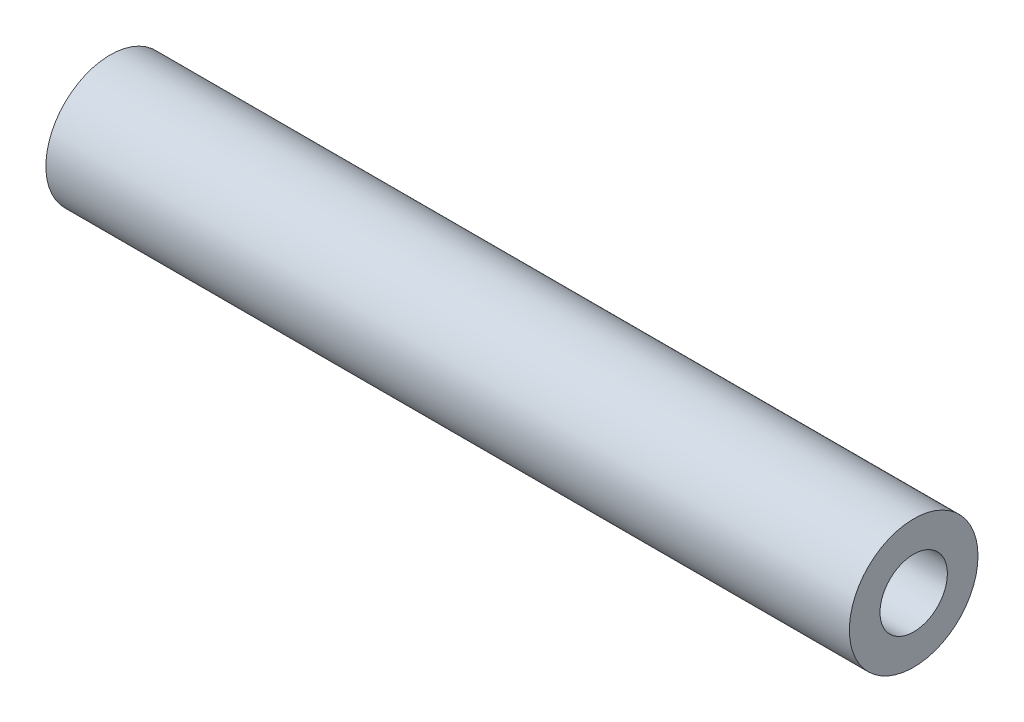
ISO-10303-21;
HEADER;
FILE_DESCRIPTION(('STEP AP214'),'2;1');
FILE_NAME('part.step','',(''),(''),'','','');
FILE_SCHEMA(('AUTOMOTIVE_DESIGN { 1 0 10303 214 1 1 1 1 }'));
ENDSEC;
DATA;
#1=APPLICATION_CONTEXT('core data for automotive mechanical design processes');
#2=APPLICATION_PROTOCOL_DEFINITION('international standard','automotive_design',2000,#1);
#3=PRODUCT_CONTEXT('',#1,'mechanical');
#4=PRODUCT('Part','Part','',(#3));
#5=PRODUCT_RELATED_PRODUCT_CATEGORY('part','',(#4));
#6=PRODUCT_DEFINITION_FORMATION('','',#4);
#7=PRODUCT_DEFINITION_CONTEXT('part definition',#1,'design');
#8=PRODUCT_DEFINITION('design','',#6,#7);
#9=PRODUCT_DEFINITION_SHAPE('','',#8);
#10=(LENGTH_UNIT() NAMED_UNIT(*) SI_UNIT(.MILLI.,.METRE.));
#11=(NAMED_UNIT(*) PLANE_ANGLE_UNIT() SI_UNIT($,.RADIAN.));
#12=(NAMED_UNIT(*) SI_UNIT($,.STERADIAN.) SOLID_ANGLE_UNIT());
#13=UNCERTAINTY_MEASURE_WITH_UNIT(LENGTH_MEASURE(1.E-05),#10,'distance_accuracy_value','');
#14=(GEOMETRIC_REPRESENTATION_CONTEXT(3) GLOBAL_UNCERTAINTY_ASSIGNED_CONTEXT((#13)) GLOBAL_UNIT_ASSIGNED_CONTEXT((#10,
#11,#12)) REPRESENTATION_CONTEXT('',''));
#15=CARTESIAN_POINT('',(0.,0.,0.));
#16=DIRECTION('',(0.,0.,1.));
#17=DIRECTION('',(1.,0.,0.));
#18=AXIS2_PLACEMENT_3D('',#15,#16,#17);
#19=CARTESIAN_POINT('',(-86.1943594012929,0.,3.06993608826518));
#20=DIRECTION('',(0.999999999999999,0.,0.));
#21=DIRECTION('',(0.,0.,-0.999999999999998));
#22=AXIS2_PLACEMENT_3D('',#19,#20,#21);
#23=PLANE('',#22);
#24=CARTESIAN_POINT('',(-86.1943594012929,0.,3.06993608826518));
#25=DIRECTION('',(0.999999999999999,0.,0.));
#26=DIRECTION('',(0.,0.,-0.999999999999998));
#27=AXIS2_PLACEMENT_3D('',#24,#25,#26);
#28=CIRCLE('',#27,3.302);
#29=CARTESIAN_POINT('',(-86.1943594012929,0.,-0.232063911734819));
#30=VERTEX_POINT('',#29);
#31=EDGE_CURVE('E55',#30,#30,#28,.T.);
#32=ORIENTED_EDGE('',*,*,#31,.T.);
#33=EDGE_LOOP('',(#32));
#34=FACE_BOUND('',#33,.T.);
#35=CARTESIAN_POINT('',(-86.1943594012929,0.,3.06993608826518));
#36=DIRECTION('',(0.999999999999999,0.,0.));
#37=DIRECTION('',(0.,0.,-0.999999999999998));
#38=AXIS2_PLACEMENT_3D('',#35,#36,#37);
#39=CIRCLE('',#38,6.302);
#40=CARTESIAN_POINT('',(-86.1943594012929,-1.00292996130236E-13,-3.23206391173481));
#41=VERTEX_POINT('',#40);
#42=EDGE_CURVE('E40',#41,#41,#39,.T.);
#43=ORIENTED_EDGE('',*,*,#42,.F.);
#44=EDGE_LOOP('',(#43));
#45=FACE_BOUND('',#44,.T.);
#46=ADVANCED_FACE('F36',(#34,#45),#23,.F.);
#47=CARTESIAN_POINT('',(-7.45435940129291,0.,3.06993608826523));
#48=DIRECTION('',(0.999999999999999,0.,0.));
#49=DIRECTION('',(0.,0.,-0.999999999999998));
#50=AXIS2_PLACEMENT_3D('',#47,#48,#49);
#51=PLANE('',#50);
#52=CARTESIAN_POINT('',(-7.45435940129291,0.,3.06993608826523));
#53=DIRECTION('',(0.999999999999999,0.,0.));
#54=DIRECTION('',(0.,0.,-0.999999999999998));
#55=AXIS2_PLACEMENT_3D('',#52,#53,#54);
#56=CIRCLE('',#55,3.302);
#57=CARTESIAN_POINT('',(-7.45435940129291,0.,-0.232063911734777));
#58=VERTEX_POINT('',#57);
#59=EDGE_CURVE('E50',#58,#58,#56,.T.);
#60=ORIENTED_EDGE('',*,*,#59,.F.);
#61=EDGE_LOOP('',(#60));
#62=FACE_BOUND('',#61,.T.);
#63=CARTESIAN_POINT('',(-7.45435940129291,0.,3.06993608826523));
#64=DIRECTION('',(0.999999999999999,0.,0.));
#65=DIRECTION('',(0.,0.,-0.999999999999998));
#66=AXIS2_PLACEMENT_3D('',#63,#64,#65);
#67=CIRCLE('',#66,6.302);
#68=CARTESIAN_POINT('',(-7.45435940129291,0.,-3.23206391173477));
#69=VERTEX_POINT('',#68);
#70=EDGE_CURVE('E11',#69,#69,#67,.T.);
#71=ORIENTED_EDGE('',*,*,#70,.T.);
#72=EDGE_LOOP('',(#71));
#73=FACE_BOUND('',#72,.T.);
#74=ADVANCED_FACE('F70',(#62,#73),#51,.T.);
#75=CARTESIAN_POINT('',(-86.1943594012929,0.,3.06993608826518));
#76=DIRECTION('',(0.999999999999999,0.,0.));
#77=DIRECTION('',(0.,0.,-0.999999999999998));
#78=AXIS2_PLACEMENT_3D('',#75,#76,#77);
#79=CYLINDRICAL_SURFACE('',#78,6.302);
#80=CARTESIAN_POINT('',(-7.45435940129291,0.,-3.23206391173477));
#81=CARTESIAN_POINT('',(-8.27456773462625,0.,-3.23206391173477));
#82=CARTESIAN_POINT('',(-9.09477606795958,0.,-3.23206391173477));
#83=CARTESIAN_POINT('',(-10.7351927346262,0.,-3.23206391173477));
#84=CARTESIAN_POINT('',(-11.5554010679596,0.,-3.23206391173477));
#85=CARTESIAN_POINT('',(-13.1958177346262,0.,-3.23206391173478));
#86=CARTESIAN_POINT('',(-14.0160260679596,0.,-3.23206391173478));
#87=CARTESIAN_POINT('',(-15.6564427346263,0.,-3.23206391173478));
#88=CARTESIAN_POINT('',(-16.4766510679596,0.,-3.23206391173478));
#89=CARTESIAN_POINT('',(-18.1170677346262,0.,-3.23206391173478));
#90=CARTESIAN_POINT('',(-18.9372760679596,0.,-3.23206391173478));
#91=CARTESIAN_POINT('',(-20.5776927346262,0.,-3.23206391173478));
#92=CARTESIAN_POINT('',(-21.3979010679596,0.,-3.23206391173478));
#93=CARTESIAN_POINT('',(-23.0383177346262,0.,-3.23206391173478));
#94=CARTESIAN_POINT('',(-23.8585260679596,0.,-3.23206391173478));
#95=CARTESIAN_POINT('',(-25.4989427346262,0.,-3.23206391173478));
#96=CARTESIAN_POINT('',(-26.3191510679596,0.,-3.23206391173478));
#97=CARTESIAN_POINT('',(-27.9595677346262,0.,-3.23206391173478));
#98=CARTESIAN_POINT('',(-28.7797760679596,0.,-3.23206391173478));
#99=CARTESIAN_POINT('',(-30.4201927346262,0.,-3.23206391173478));
#100=CARTESIAN_POINT('',(-31.2404010679596,0.,-3.23206391173478));
#101=CARTESIAN_POINT('',(-32.8808177346262,0.,-3.23206391173479));
#102=CARTESIAN_POINT('',(-33.7010260679596,0.,-3.23206391173479));
#103=CARTESIAN_POINT('',(-35.3414427346262,0.,-3.23206391173479));
#104=CARTESIAN_POINT('',(-36.1616510679596,0.,-3.23206391173479));
#105=CARTESIAN_POINT('',(-37.8020677346262,0.,-3.23206391173479));
#106=CARTESIAN_POINT('',(-38.6222760679596,0.,-3.23206391173479));
#107=CARTESIAN_POINT('',(-40.2626927346262,0.,-3.23206391173479));
#108=CARTESIAN_POINT('',(-41.0829010679596,0.,-3.23206391173479));
#109=CARTESIAN_POINT('',(-42.7233177346262,0.,-3.23206391173479));
#110=CARTESIAN_POINT('',(-43.5435260679596,0.,-3.23206391173479));
#111=CARTESIAN_POINT('',(-45.1839427346262,0.,-3.23206391173479));
#112=CARTESIAN_POINT('',(-46.0041510679596,0.,-3.23206391173479));
#113=CARTESIAN_POINT('',(-47.6445677346262,0.,-3.23206391173479));
#114=CARTESIAN_POINT('',(-48.4647760679596,0.,-3.23206391173479));
#115=CARTESIAN_POINT('',(-50.1051927346262,0.,-3.23206391173479));
#116=CARTESIAN_POINT('',(-50.9254010679596,0.,-3.2320639117348));
#117=CARTESIAN_POINT('',(-52.5658177346262,0.,-3.2320639117348));
#118=CARTESIAN_POINT('',(-53.3860260679596,0.,-3.2320639117348));
#119=CARTESIAN_POINT('',(-55.0264427346262,0.,-3.2320639117348));
#120=CARTESIAN_POINT('',(-55.8466510679595,0.,-3.2320639117348));
#121=CARTESIAN_POINT('',(-57.4870677346262,0.,-3.2320639117348));
#122=CARTESIAN_POINT('',(-58.3072760679596,0.,-3.2320639117348));
#123=CARTESIAN_POINT('',(-59.9476927346262,0.,-3.2320639117348));
#124=CARTESIAN_POINT('',(-60.7679010679595,0.,-3.2320639117348));
#125=CARTESIAN_POINT('',(-62.4083177346262,0.,-3.2320639117348));
#126=CARTESIAN_POINT('',(-63.2285260679595,0.,-3.2320639117348));
#127=CARTESIAN_POINT('',(-64.8689427346262,0.,-3.2320639117348));
#128=CARTESIAN_POINT('',(-65.6891510679595,0.,-3.2320639117348));
#129=CARTESIAN_POINT('',(-67.3295677346262,0.,-3.2320639117348));
#130=CARTESIAN_POINT('',(-68.1497760679596,0.,-3.2320639117348));
#131=CARTESIAN_POINT('',(-69.7901927346262,0.,-3.23206391173481));
#132=CARTESIAN_POINT('',(-70.6104010679595,0.,-3.23206391173481));
#133=CARTESIAN_POINT('',(-72.2508177346262,0.,-3.23206391173481));
#134=CARTESIAN_POINT('',(-73.0710260679595,0.,-3.23206391173481));
#135=CARTESIAN_POINT('',(-74.7114427346262,0.,-3.23206391173481));
#136=CARTESIAN_POINT('',(-75.5316510679595,0.,-3.23206391173481));
#137=CARTESIAN_POINT('',(-77.1720677346262,0.,-3.23206391173481));
#138=CARTESIAN_POINT('',(-77.9922760679595,0.,-3.23206391173481));
#139=CARTESIAN_POINT('',(-79.6326927346262,0.,-3.23206391173481));
#140=CARTESIAN_POINT('',(-80.4529010679595,0.,-3.23206391173481));
#141=CARTESIAN_POINT('',(-82.0933177346262,0.,-3.23206391173481));
#142=CARTESIAN_POINT('',(-82.9135260679595,0.,-3.23206391173481));
#143=CARTESIAN_POINT('',(-84.5539427346262,0.,-3.23206391173481));
#144=CARTESIAN_POINT('',(-85.3741510679595,0.,-3.23206391173481));
#145=CARTESIAN_POINT('',(-86.1943594012929,-1.00292996130236E-13,-3.23206391173481));
#146=B_SPLINE_CURVE_WITH_KNOTS('',3,(#80,#81,#82,#83,#84,#85,#86,#87,#88,#89,#90,#91,#92,#93,
#94,#95,#96,#97,#98,#99,#100,#101,#102,#103,#104,#105,#106,#107,#108,#109,#110,#111,#112,#113,
#114,#115,#116,#117,#118,#119,#120,#121,#122,#123,#124,#125,#126,#127,#128,#129,#130,#131,#132,
#133,#134,#135,#136,#137,#138,#139,#140,#141,#142,#143,#144,#145),.UNSPECIFIED.,.F.,.F.,(4,2,2,
2,2,2,2,2,2,2,2,2,2,2,2,2,2,2,2,2,2,2,2,2,2,2,2,2,2,2,2,2,4),(0.,2.46062500000001,4.92125,
7.38187500000001,9.8425,12.303125,14.76375,17.224375,19.685,22.145625,24.60625,27.066875,
29.5275,31.988125,34.44875,36.909375,39.37,41.830625,44.29125,46.751875,49.2125,51.673125,
54.13375,56.594375,59.055,61.515625,63.97625,66.436875,68.8975,71.358125,73.81875,76.279375,
78.74),.UNSPECIFIED.);
#147=EDGE_CURVE('BSEAM38',#69,#41,#146,.T.);
#148=ORIENTED_EDGE('',*,*,#70,.F.);
#149=ORIENTED_EDGE('',*,*,#42,.T.);
#150=ORIENTED_EDGE('',*,*,#147,.T.);
#151=ORIENTED_EDGE('',*,*,#147,.F.);
#152=EDGE_LOOP('',(#148,#150,#149,#151));
#153=FACE_BOUND('',#152,.T.);
#154=ADVANCED_FACE('F38',(#153),#79,.T.);
#155=CARTESIAN_POINT('',(-86.1943594012929,0.,3.06993608826518));
#156=DIRECTION('',(0.999999999999999,0.,0.));
#157=DIRECTION('',(0.,0.,-0.999999999999998));
#158=AXIS2_PLACEMENT_3D('',#155,#156,#157);
#159=CYLINDRICAL_SURFACE('',#158,3.302);
#160=CARTESIAN_POINT('',(-7.45435940129291,0.,-0.232063911734777));
#161=CARTESIAN_POINT('',(-8.27456773462625,0.,-0.232063911734778));
#162=CARTESIAN_POINT('',(-9.09477606795958,0.,-0.232063911734778));
#163=CARTESIAN_POINT('',(-10.7351927346262,0.,-0.232063911734779));
#164=CARTESIAN_POINT('',(-11.5554010679596,0.,-0.232063911734779));
#165=CARTESIAN_POINT('',(-13.1958177346262,0.,-0.23206391173478));
#166=CARTESIAN_POINT('',(-14.0160260679596,0.,-0.232063911734781));
#167=CARTESIAN_POINT('',(-15.6564427346263,0.,-0.232063911734781));
#168=CARTESIAN_POINT('',(-16.4766510679596,0.,-0.232063911734782));
#169=CARTESIAN_POINT('',(-18.1170677346262,0.,-0.232063911734783));
#170=CARTESIAN_POINT('',(-18.9372760679596,0.,-0.232063911734783));
#171=CARTESIAN_POINT('',(-20.5776927346262,0.,-0.232063911734784));
#172=CARTESIAN_POINT('',(-21.3979010679596,0.,-0.232063911734784));
#173=CARTESIAN_POINT('',(-23.0383177346262,0.,-0.232063911734785));
#174=CARTESIAN_POINT('',(-23.8585260679596,0.,-0.232063911734786));
#175=CARTESIAN_POINT('',(-25.4989427346262,0.,-0.232063911734787));
#176=CARTESIAN_POINT('',(-26.3191510679596,0.,-0.232063911734787));
#177=CARTESIAN_POINT('',(-27.9595677346262,0.,-0.232063911734788));
#178=CARTESIAN_POINT('',(-28.7797760679596,0.,-0.232063911734788));
#179=CARTESIAN_POINT('',(-30.4201927346262,0.,-0.232063911734789));
#180=CARTESIAN_POINT('',(-31.2404010679596,0.,-0.23206391173479));
#181=CARTESIAN_POINT('',(-32.8808177346262,0.,-0.23206391173479));
#182=CARTESIAN_POINT('',(-33.7010260679596,0.,-0.232063911734791));
#183=CARTESIAN_POINT('',(-35.3414427346262,0.,-0.232063911734792));
#184=CARTESIAN_POINT('',(-36.1616510679596,0.,-0.232063911734792));
#185=CARTESIAN_POINT('',(-37.8020677346262,0.,-0.232063911734793));
#186=CARTESIAN_POINT('',(-38.6222760679596,0.,-0.232063911734794));
#187=CARTESIAN_POINT('',(-40.2626927346262,0.,-0.232063911734794));
#188=CARTESIAN_POINT('',(-41.0829010679596,0.,-0.232063911734795));
#189=CARTESIAN_POINT('',(-42.7233177346262,0.,-0.232063911734796));
#190=CARTESIAN_POINT('',(-43.5435260679596,0.,-0.232063911734796));
#191=CARTESIAN_POINT('',(-45.1839427346262,0.,-0.232063911734797));
#192=CARTESIAN_POINT('',(-46.0041510679596,0.,-0.232063911734797));
#193=CARTESIAN_POINT('',(-47.6445677346262,0.,-0.232063911734798));
#194=CARTESIAN_POINT('',(-48.4647760679596,0.,-0.232063911734799));
#195=CARTESIAN_POINT('',(-50.1051927346262,0.,-0.2320639117348));
#196=CARTESIAN_POINT('',(-50.9254010679596,0.,-0.2320639117348));
#197=CARTESIAN_POINT('',(-52.5658177346262,0.,-0.232063911734801));
#198=CARTESIAN_POINT('',(-53.3860260679596,0.,-0.232063911734801));
#199=CARTESIAN_POINT('',(-55.0264427346262,0.,-0.232063911734802));
#200=CARTESIAN_POINT('',(-55.8466510679596,0.,-0.232063911734803));
#201=CARTESIAN_POINT('',(-57.4870677346262,0.,-0.232063911734803));
#202=CARTESIAN_POINT('',(-58.3072760679596,0.,-0.232063911734804));
#203=CARTESIAN_POINT('',(-59.9476927346262,0.,-0.232063911734805));
#204=CARTESIAN_POINT('',(-60.7679010679596,0.,-0.232063911734805));
#205=CARTESIAN_POINT('',(-62.4083177346262,0.,-0.232063911734806));
#206=CARTESIAN_POINT('',(-63.2285260679596,0.,-0.232063911734806));
#207=CARTESIAN_POINT('',(-64.8689427346262,0.,-0.232063911734807));
#208=CARTESIAN_POINT('',(-65.6891510679596,0.,-0.232063911734808));
#209=CARTESIAN_POINT('',(-67.3295677346262,0.,-0.232063911734809));
#210=CARTESIAN_POINT('',(-68.1497760679596,0.,-0.232063911734809));
#211=CARTESIAN_POINT('',(-69.7901927346262,0.,-0.23206391173481));
#212=CARTESIAN_POINT('',(-70.6104010679596,0.,-0.23206391173481));
#213=CARTESIAN_POINT('',(-72.2508177346262,0.,-0.232063911734811));
#214=CARTESIAN_POINT('',(-73.0710260679596,0.,-0.232063911734812));
#215=CARTESIAN_POINT('',(-74.7114427346262,0.,-0.232063911734812));
#216=CARTESIAN_POINT('',(-75.5316510679596,0.,-0.232063911734813));
#217=CARTESIAN_POINT('',(-77.1720677346262,0.,-0.232063911734814));
#218=CARTESIAN_POINT('',(-77.9922760679596,0.,-0.232063911734814));
#219=CARTESIAN_POINT('',(-79.6326927346262,0.,-0.232063911734815));
#220=CARTESIAN_POINT('',(-80.4529010679595,0.,-0.232063911734815));
#221=CARTESIAN_POINT('',(-82.0933177346262,0.,-0.232063911734816));
#222=CARTESIAN_POINT('',(-82.9135260679595,0.,-0.232063911734817));
#223=CARTESIAN_POINT('',(-84.5539427346262,0.,-0.232063911734818));
#224=CARTESIAN_POINT('',(-85.3741510679595,0.,-0.232063911734818));
#225=CARTESIAN_POINT('',(-86.1943594012929,0.,-0.232063911734819));
#226=B_SPLINE_CURVE_WITH_KNOTS('',3,(#160,#161,#162,#163,#164,#165,#166,#167,#168,#169,#170,
#171,#172,#173,#174,#175,#176,#177,#178,#179,#180,#181,#182,#183,#184,#185,#186,#187,#188,#189,
#190,#191,#192,#193,#194,#195,#196,#197,#198,#199,#200,#201,#202,#203,#204,#205,#206,#207,#208,
#209,#210,#211,#212,#213,#214,#215,#216,#217,#218,#219,#220,#221,#222,#223,#224,#225),
.UNSPECIFIED.,.F.,.F.,(4,2,2,2,2,2,2,2,2,2,2,2,2,2,2,2,2,2,2,2,2,2,2,2,2,2,2,2,2,2,2,2,4),(0.,
2.46062500000001,4.92125,7.38187500000001,9.8425,12.303125,14.76375,17.224375,19.685,22.145625,
24.60625,27.066875,29.5275,31.988125,34.44875,36.909375,39.37,41.830625,44.29125,46.751875,
49.2125,51.673125,54.13375,56.594375,59.055,61.515625,63.97625,66.436875,68.8975,71.358125,
73.81875,76.279375,78.74),.UNSPECIFIED.);
#227=EDGE_CURVE('BSEAM63',#58,#30,#226,.T.);
#228=ORIENTED_EDGE('',*,*,#59,.T.);
#229=ORIENTED_EDGE('',*,*,#31,.F.);
#230=ORIENTED_EDGE('',*,*,#227,.T.);
#231=ORIENTED_EDGE('',*,*,#227,.F.);
#232=EDGE_LOOP('',(#228,#230,#229,#231));
#233=FACE_BOUND('',#232,.T.);
#234=ADVANCED_FACE('F63',(#233),#159,.F.);
#235=CLOSED_SHELL('',(#46,#74,#154,#234));
#236=MANIFOLD_SOLID_BREP('B2',#235);
#237=ADVANCED_BREP_SHAPE_REPRESENTATION('',(#18,#236),#14);
#238=SHAPE_DEFINITION_REPRESENTATION(#9,#237);
ENDSEC;
END-ISO-10303-21;
